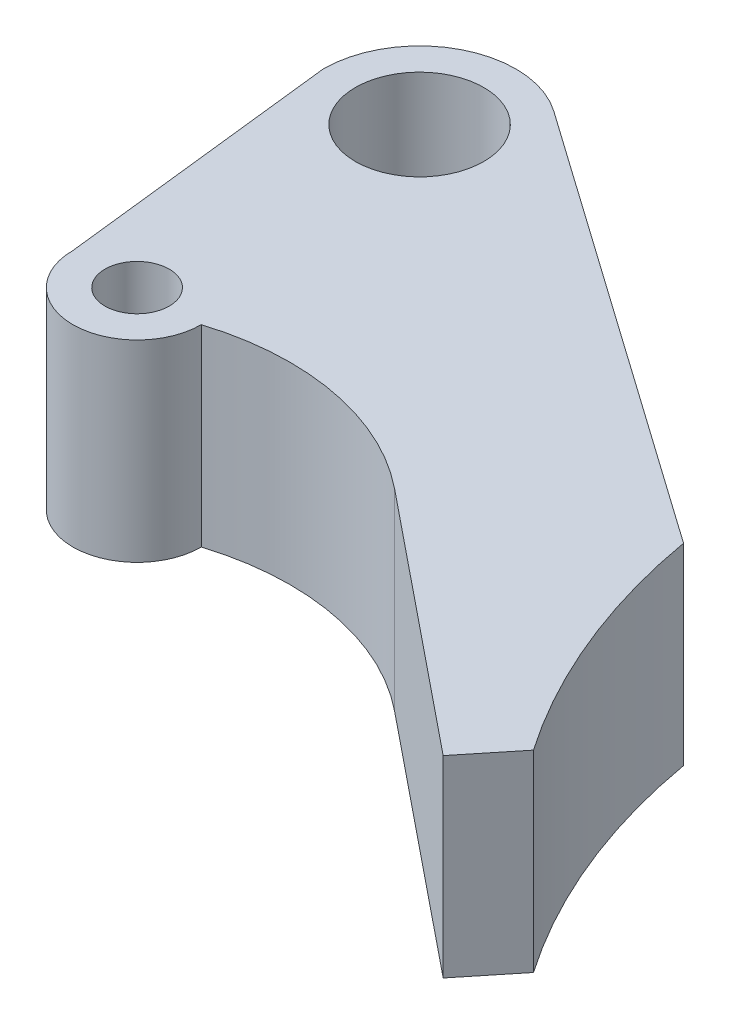
ISO-10303-21;
HEADER;
FILE_DESCRIPTION(('STEP AP214'),'2;1');
FILE_NAME('part.step','',(''),(''),'','','');
FILE_SCHEMA(('AUTOMOTIVE_DESIGN { 1 0 10303 214 1 1 1 1 }'));
ENDSEC;
DATA;
#1=APPLICATION_CONTEXT('core data for automotive mechanical design processes');
#2=APPLICATION_PROTOCOL_DEFINITION('international standard','automotive_design',2000,#1);
#3=PRODUCT_CONTEXT('',#1,'mechanical');
#4=PRODUCT('Part','Part','',(#3));
#5=PRODUCT_RELATED_PRODUCT_CATEGORY('part','',(#4));
#6=PRODUCT_DEFINITION_FORMATION('','',#4);
#7=PRODUCT_DEFINITION_CONTEXT('part definition',#1,'design');
#8=PRODUCT_DEFINITION('design','',#6,#7);
#9=PRODUCT_DEFINITION_SHAPE('','',#8);
#10=(LENGTH_UNIT() NAMED_UNIT(*) SI_UNIT(.MILLI.,.METRE.));
#11=(NAMED_UNIT(*) PLANE_ANGLE_UNIT() SI_UNIT($,.RADIAN.));
#12=(NAMED_UNIT(*) SI_UNIT($,.STERADIAN.) SOLID_ANGLE_UNIT());
#13=UNCERTAINTY_MEASURE_WITH_UNIT(LENGTH_MEASURE(1.E-05),#10,'distance_accuracy_value','');
#14=(GEOMETRIC_REPRESENTATION_CONTEXT(3) GLOBAL_UNCERTAINTY_ASSIGNED_CONTEXT((#13)) GLOBAL_UNIT_ASSIGNED_CONTEXT((#10,
#11,#12)) REPRESENTATION_CONTEXT('',''));
#15=CARTESIAN_POINT('',(0.,0.,0.));
#16=DIRECTION('',(0.,0.,1.));
#17=DIRECTION('',(1.,0.,0.));
#18=AXIS2_PLACEMENT_3D('',#15,#16,#17);
#19=CARTESIAN_POINT('',(175.539976401458,30.,-5.34273223660473));
#20=DIRECTION('',(0.,-1.,0.));
#21=DIRECTION('',(0.,0.,-1.));
#22=AXIS2_PLACEMENT_3D('',#19,#20,#21);
#23=CYLINDRICAL_SURFACE('',#22,100.);
#24=CARTESIAN_POINT('',(175.539976401458,0.,-5.34273223660473));
#25=DIRECTION('',(0.,1.,0.));
#26=DIRECTION('',(0.,0.,1.));
#27=AXIS2_PLACEMENT_3D('',#24,#25,#26);
#28=CIRCLE('',#27,100.);
#29=CARTESIAN_POINT('',(77.0361618981153,0.,11.8909130043512));
#30=VERTEX_POINT('',#29);
#31=CARTESIAN_POINT('',(93.2575153748367,0.,51.4868076823722));
#32=VERTEX_POINT('',#31);
#33=EDGE_CURVE('E146',#30,#32,#28,.T.);
#34=ORIENTED_EDGE('',*,*,#33,.F.);
#35=DIRECTION('',(0.,-1.,0.));
#36=VECTOR('',#35,1.);
#37=CARTESIAN_POINT('',(77.0361618981153,30.,11.8909130043512));
#38=LINE('',#37,#36);
#39=CARTESIAN_POINT('',(77.0361618981153,30.,11.8909130043512));
#40=VERTEX_POINT('',#39);
#41=EDGE_CURVE('E11',#40,#30,#38,.T.);
#42=ORIENTED_EDGE('',*,*,#41,.F.);
#43=CARTESIAN_POINT('',(175.539976401458,30.,-5.34273223660473));
#44=DIRECTION('',(0.,1.,0.));
#45=DIRECTION('',(0.,0.,1.));
#46=AXIS2_PLACEMENT_3D('',#43,#44,#45);
#47=CIRCLE('',#46,100.);
#48=CARTESIAN_POINT('',(93.2575153748367,30.,51.4868076823722));
#49=VERTEX_POINT('',#48);
#50=EDGE_CURVE('E179',#40,#49,#47,.T.);
#51=ORIENTED_EDGE('',*,*,#50,.T.);
#52=DIRECTION('',(0.,-1.,0.));
#53=VECTOR('',#52,1.);
#54=CARTESIAN_POINT('',(93.2575153748367,30.,51.4868076823722));
#55=LINE('',#54,#53);
#56=EDGE_CURVE('E55',#49,#32,#55,.T.);
#57=ORIENTED_EDGE('',*,*,#56,.T.);
#58=EDGE_LOOP('',(#34,#42,#51,#57));
#59=FACE_BOUND('',#58,.T.);
#60=ADVANCED_FACE('F38',(#59),#23,.F.);
#61=CARTESIAN_POINT('',(19.9533882722005,30.,-28.3232347309496));
#62=DIRECTION('',(-0.575922322514416,0.,0.817504421045905));
#63=DIRECTION('',(0.817504421045905,0.,0.575922322514416));
#64=AXIS2_PLACEMENT_3D('',#61,#62,#63);
#65=PLANE('',#64);
#66=DIRECTION('',(-0.817504421045905,0.,-0.575922322514416));
#67=VECTOR('',#66,1.);
#68=CARTESIAN_POINT('',(19.9533882722005,0.,-28.3232347309496));
#69=LINE('',#68,#67);
#70=CARTESIAN_POINT('',(8.63883483771625,0.,-36.2942055592966));
#71=VERTEX_POINT('',#70);
#72=EDGE_CURVE('E149',#30,#71,#69,.T.);
#73=ORIENTED_EDGE('',*,*,#72,.T.);
#74=DIRECTION('',(0.,-1.,0.));
#75=VECTOR('',#74,1.);
#76=CARTESIAN_POINT('',(8.63883483771625,30.,-36.2942055592966));
#77=LINE('',#76,#75);
#78=CARTESIAN_POINT('',(8.63883483771625,30.,-36.2942055592966));
#79=VERTEX_POINT('',#78);
#80=EDGE_CURVE('E47',#79,#71,#77,.T.);
#81=ORIENTED_EDGE('',*,*,#80,.F.);
#82=DIRECTION('',(-0.817504421045905,0.,-0.575922322514416));
#83=VECTOR('',#82,1.);
#84=CARTESIAN_POINT('',(19.9533882722005,30.,-28.3232347309496));
#85=LINE('',#84,#83);
#86=EDGE_CURVE('E224',#40,#79,#85,.T.);
#87=ORIENTED_EDGE('',*,*,#86,.F.);
#88=ORIENTED_EDGE('',*,*,#41,.T.);
#89=EDGE_LOOP('',(#73,#81,#87,#88));
#90=FACE_BOUND('',#89,.T.);
#91=ADVANCED_FACE('F244',(#90),#65,.F.);
#92=CARTESIAN_POINT('',(0.,30.,-24.0316392436081));
#93=DIRECTION('',(0.,-1.,0.));
#94=DIRECTION('',(0.,0.,-1.));
#95=AXIS2_PLACEMENT_3D('',#92,#93,#94);
#96=CYLINDRICAL_SURFACE('',#95,15.);
#97=CARTESIAN_POINT('',(0.,0.,-24.0316392436081));
#98=DIRECTION('',(0.,1.,0.));
#99=DIRECTION('',(0.,0.,1.));
#100=AXIS2_PLACEMENT_3D('',#97,#98,#99);
#101=CIRCLE('',#100,15.);
#102=CARTESIAN_POINT('',(-15.,0.,-24.0316392436081));
#103=VERTEX_POINT('',#102);
#104=EDGE_CURVE('E152',#71,#103,#101,.T.);
#105=ORIENTED_EDGE('',*,*,#104,.T.);
#106=DIRECTION('',(0.,-1.,0.));
#107=VECTOR('',#106,1.);
#108=CARTESIAN_POINT('',(-15.,30.,-24.0316392436081));
#109=LINE('',#108,#107);
#110=CARTESIAN_POINT('',(-15.,30.,-24.0316392436081));
#111=VERTEX_POINT('',#110);
#112=EDGE_CURVE('E190',#111,#103,#109,.T.);
#113=ORIENTED_EDGE('',*,*,#112,.F.);
#114=CARTESIAN_POINT('',(0.,30.,-24.0316392436081));
#115=DIRECTION('',(0.,1.,0.));
#116=DIRECTION('',(0.,0.,1.));
#117=AXIS2_PLACEMENT_3D('',#114,#115,#116);
#118=CIRCLE('',#117,15.);
#119=EDGE_CURVE('E202',#79,#111,#118,.T.);
#120=ORIENTED_EDGE('',*,*,#119,.F.);
#121=ORIENTED_EDGE('',*,*,#80,.T.);
#122=EDGE_LOOP('',(#105,#113,#120,#121));
#123=FACE_BOUND('',#122,.T.);
#124=ADVANCED_FACE('F200',(#123),#96,.T.);
#125=CARTESIAN_POINT('',(-12.1127176779226,30.,1.37644519067301));
#126=DIRECTION('',(0.993605254789719,0.,-0.112909688044285));
#127=DIRECTION('',(-0.112909688044285,0.,-0.993605254789719));
#128=AXIS2_PLACEMENT_3D('',#125,#126,#127);
#129=PLANE('',#128);
#130=DIRECTION('',(0.112909688044285,0.,0.993605254789719));
#131=VECTOR('',#130,1.);
#132=CARTESIAN_POINT('',(-12.1127176779226,0.,1.37644519067301));
#133=LINE('',#132,#131);
#134=CARTESIAN_POINT('',(-10.,0.,19.9683607563919));
#135=VERTEX_POINT('',#134);
#136=EDGE_CURVE('E155',#103,#135,#133,.T.);
#137=ORIENTED_EDGE('',*,*,#136,.T.);
#138=DIRECTION('',(0.,-1.,0.));
#139=VECTOR('',#138,1.);
#140=CARTESIAN_POINT('',(-10.,30.,19.9683607563919));
#141=LINE('',#140,#139);
#142=CARTESIAN_POINT('',(-10.,30.,19.9683607563919));
#143=VERTEX_POINT('',#142);
#144=EDGE_CURVE('E186',#143,#135,#141,.T.);
#145=ORIENTED_EDGE('',*,*,#144,.F.);
#146=DIRECTION('',(0.112909688044285,0.,0.993605254789719));
#147=VECTOR('',#146,1.);
#148=CARTESIAN_POINT('',(-12.1127176779226,30.,1.37644519067301));
#149=LINE('',#148,#147);
#150=EDGE_CURVE('E217',#111,#143,#149,.T.);
#151=ORIENTED_EDGE('',*,*,#150,.F.);
#152=ORIENTED_EDGE('',*,*,#112,.T.);
#153=EDGE_LOOP('',(#137,#145,#151,#152));
#154=FACE_BOUND('',#153,.T.);
#155=ADVANCED_FACE('F212',(#154),#129,.F.);
#156=CARTESIAN_POINT('',(0.,30.,19.9683607563919));
#157=DIRECTION('',(0.,-1.,0.));
#158=DIRECTION('',(0.,0.,-1.));
#159=AXIS2_PLACEMENT_3D('',#156,#157,#158);
#160=CYLINDRICAL_SURFACE('',#159,9.99999999999999);
#161=CARTESIAN_POINT('',(0.,0.,19.9683607563919));
#162=DIRECTION('',(0.,1.,0.));
#163=DIRECTION('',(0.,0.,1.));
#164=AXIS2_PLACEMENT_3D('',#161,#162,#163);
#165=CIRCLE('',#164,9.99999999999999);
#166=CARTESIAN_POINT('',(10.,0.,19.9683607563919));
#167=VERTEX_POINT('',#166);
#168=EDGE_CURVE('E158',#135,#167,#165,.T.);
#169=ORIENTED_EDGE('',*,*,#168,.T.);
#170=DIRECTION('',(0.,-1.,0.));
#171=VECTOR('',#170,1.);
#172=CARTESIAN_POINT('',(10.,30.,19.9683607563919));
#173=LINE('',#172,#171);
#174=CARTESIAN_POINT('',(10.,30.,19.9683607563919));
#175=VERTEX_POINT('',#174);
#176=EDGE_CURVE('E115',#175,#167,#173,.T.);
#177=ORIENTED_EDGE('',*,*,#176,.F.);
#178=CARTESIAN_POINT('',(0.,30.,19.9683607563919));
#179=DIRECTION('',(0.,1.,0.));
#180=DIRECTION('',(0.,0.,1.));
#181=AXIS2_PLACEMENT_3D('',#178,#179,#180);
#182=CIRCLE('',#181,9.99999999999999);
#183=EDGE_CURVE('E125',#143,#175,#182,.T.);
#184=ORIENTED_EDGE('',*,*,#183,.F.);
#185=ORIENTED_EDGE('',*,*,#144,.T.);
#186=EDGE_LOOP('',(#169,#177,#184,#185));
#187=FACE_BOUND('',#186,.T.);
#188=ADVANCED_FACE('F215',(#187),#160,.T.);
#189=CARTESIAN_POINT('',(22.0038610111941,30.,58.1247143665567));
#190=DIRECTION('',(0.,-1.,0.));
#191=DIRECTION('',(0.,0.,-1.));
#192=AXIS2_PLACEMENT_3D('',#189,#190,#191);
#193=CYLINDRICAL_SURFACE('',#192,40.);
#194=CARTESIAN_POINT('',(22.0038610111941,0.,58.1247143665567));
#195=DIRECTION('',(0.,1.,0.));
#196=DIRECTION('',(0.,0.,1.));
#197=AXIS2_PLACEMENT_3D('',#194,#195,#196);
#198=CIRCLE('',#197,40.);
#199=CARTESIAN_POINT('',(47.1766766531877,0.,27.038875908278));
#200=VERTEX_POINT('',#199);
#201=EDGE_CURVE('E110',#200,#167,#198,.T.);
#202=ORIENTED_EDGE('',*,*,#201,.F.);
#203=DIRECTION('',(0.,-1.,0.));
#204=VECTOR('',#203,1.);
#205=CARTESIAN_POINT('',(47.1766766531877,30.,27.038875908278));
#206=LINE('',#205,#204);
#207=CARTESIAN_POINT('',(47.1766766531877,30.,27.038875908278));
#208=VERTEX_POINT('',#207);
#209=EDGE_CURVE('E105',#208,#200,#206,.T.);
#210=ORIENTED_EDGE('',*,*,#209,.F.);
#211=CARTESIAN_POINT('',(22.0038610111941,30.,58.1247143665567));
#212=DIRECTION('',(0.,1.,0.));
#213=DIRECTION('',(0.,0.,1.));
#214=AXIS2_PLACEMENT_3D('',#211,#212,#213);
#215=CIRCLE('',#214,40.);
#216=EDGE_CURVE('E108',#208,#175,#215,.T.);
#217=ORIENTED_EDGE('',*,*,#216,.T.);
#218=ORIENTED_EDGE('',*,*,#176,.T.);
#219=EDGE_LOOP('',(#202,#210,#217,#218));
#220=FACE_BOUND('',#219,.T.);
#221=ADVANCED_FACE('F107',(#220),#193,.F.);
#222=CARTESIAN_POINT('',(5.46004122341992,30.,-6.74258938136537));
#223=DIRECTION('',(-0.629320391049841,0.,0.777145961456968));
#224=DIRECTION('',(0.777145961456968,0.,0.629320391049841));
#225=AXIS2_PLACEMENT_3D('',#222,#223,#224);
#226=PLANE('',#225);
#227=DIRECTION('',(-0.777145961456968,0.,-0.629320391049841));
#228=VECTOR('',#227,1.);
#229=CARTESIAN_POINT('',(5.46004122341992,0.,-6.74258938136537));
#230=LINE('',#229,#228);
#231=CARTESIAN_POINT('',(86.9643114643383,0.,59.2582672969419));
#232=VERTEX_POINT('',#231);
#233=EDGE_CURVE('E164',#232,#200,#230,.T.);
#234=ORIENTED_EDGE('',*,*,#233,.F.);
#235=DIRECTION('',(0.,-1.,0.));
#236=VECTOR('',#235,1.);
#237=CARTESIAN_POINT('',(86.9643114643383,30.,59.2582672969419));
#238=LINE('',#237,#236);
#239=CARTESIAN_POINT('',(86.9643114643383,30.,59.2582672969419));
#240=VERTEX_POINT('',#239);
#241=EDGE_CURVE('E80',#240,#232,#238,.T.);
#242=ORIENTED_EDGE('',*,*,#241,.F.);
#243=DIRECTION('',(-0.777145961456968,0.,-0.629320391049841));
#244=VECTOR('',#243,1.);
#245=CARTESIAN_POINT('',(5.46004122341992,30.,-6.74258938136537));
#246=LINE('',#245,#244);
#247=EDGE_CURVE('E123',#240,#208,#246,.T.);
#248=ORIENTED_EDGE('',*,*,#247,.T.);
#249=ORIENTED_EDGE('',*,*,#209,.T.);
#250=EDGE_LOOP('',(#234,#242,#248,#249));
#251=FACE_BOUND('',#250,.T.);
#252=ADVANCED_FACE('F129',(#251),#226,.T.);
#253=CARTESIAN_POINT('',(0.,30.,-24.0316392436081));
#254=DIRECTION('',(0.,-1.,0.));
#255=DIRECTION('',(0.,0.,-1.));
#256=AXIS2_PLACEMENT_3D('',#253,#254,#255);
#257=CYLINDRICAL_SURFACE('',#256,10.);
#258=CARTESIAN_POINT('',(0.,30.,-24.0316392436081));
#259=DIRECTION('',(0.,1.,0.));
#260=DIRECTION('',(0.,0.,1.));
#261=AXIS2_PLACEMENT_3D('',#258,#259,#260);
#262=CIRCLE('',#261,10.);
#263=CARTESIAN_POINT('',(0.,30.,-14.0316392436081));
#264=VERTEX_POINT('',#263);
#265=EDGE_CURVE('E135',#264,#264,#262,.T.);
#266=ORIENTED_EDGE('',*,*,#265,.T.);
#267=EDGE_LOOP('',(#266));
#268=FACE_BOUND('',#267,.T.);
#269=CARTESIAN_POINT('',(0.,0.,-24.0316392436081));
#270=DIRECTION('',(0.,1.,0.));
#271=DIRECTION('',(0.,0.,1.));
#272=AXIS2_PLACEMENT_3D('',#269,#270,#271);
#273=CIRCLE('',#272,10.);
#274=CARTESIAN_POINT('',(0.,0.,-14.0316392436081));
#275=VERTEX_POINT('',#274);
#276=EDGE_CURVE('E171',#275,#275,#273,.T.);
#277=ORIENTED_EDGE('',*,*,#276,.F.);
#278=EDGE_LOOP('',(#277));
#279=FACE_BOUND('',#278,.T.);
#280=ADVANCED_FACE('F232',(#268,#279),#257,.F.);
#281=CARTESIAN_POINT('',(81.5042702409184,30.,66.0008566783072));
#282=DIRECTION('',(0.777145961456969,0.,0.62932039104984));
#283=DIRECTION('',(0.62932039104984,0.,-0.777145961456969));
#284=AXIS2_PLACEMENT_3D('',#281,#282,#283);
#285=PLANE('',#284);
#286=DIRECTION('',(-0.62932039104984,0.,0.777145961456969));
#287=VECTOR('',#286,1.);
#288=CARTESIAN_POINT('',(81.5042702409184,0.,66.0008566783072));
#289=LINE('',#288,#287);
#290=EDGE_CURVE('E167',#32,#232,#289,.T.);
#291=ORIENTED_EDGE('',*,*,#290,.F.);
#292=ORIENTED_EDGE('',*,*,#56,.F.);
#293=DIRECTION('',(-0.62932039104984,0.,0.777145961456969));
#294=VECTOR('',#293,1.);
#295=CARTESIAN_POINT('',(81.5042702409184,30.,66.0008566783072));
#296=LINE('',#295,#294);
#297=EDGE_CURVE('E131',#49,#240,#296,.T.);
#298=ORIENTED_EDGE('',*,*,#297,.T.);
#299=ORIENTED_EDGE('',*,*,#241,.T.);
#300=EDGE_LOOP('',(#291,#292,#298,#299));
#301=FACE_BOUND('',#300,.T.);
#302=ADVANCED_FACE('F229',(#301),#285,.T.);
#303=CARTESIAN_POINT('',(0.,30.,19.9683607563919));
#304=DIRECTION('',(0.,-1.,0.));
#305=DIRECTION('',(0.,0.,-1.));
#306=AXIS2_PLACEMENT_3D('',#303,#304,#305);
#307=CYLINDRICAL_SURFACE('',#306,5.);
#308=CARTESIAN_POINT('',(0.,30.,19.9683607563919));
#309=DIRECTION('',(0.,1.,0.));
#310=DIRECTION('',(0.,0.,1.));
#311=AXIS2_PLACEMENT_3D('',#308,#309,#310);
#312=CIRCLE('',#311,5.);
#313=CARTESIAN_POINT('',(0.,30.,24.9683607563919));
#314=VERTEX_POINT('',#313);
#315=EDGE_CURVE('E142',#314,#314,#312,.T.);
#316=ORIENTED_EDGE('',*,*,#315,.T.);
#317=EDGE_LOOP('',(#316));
#318=FACE_BOUND('',#317,.T.);
#319=CARTESIAN_POINT('',(0.,0.,19.9683607563919));
#320=DIRECTION('',(0.,1.,0.));
#321=DIRECTION('',(0.,0.,1.));
#322=AXIS2_PLACEMENT_3D('',#319,#320,#321);
#323=CIRCLE('',#322,5.);
#324=CARTESIAN_POINT('',(0.,0.,24.9683607563919));
#325=VERTEX_POINT('',#324);
#326=EDGE_CURVE('E175',#325,#325,#323,.T.);
#327=ORIENTED_EDGE('',*,*,#326,.F.);
#328=EDGE_LOOP('',(#327));
#329=FACE_BOUND('',#328,.T.);
#330=ADVANCED_FACE('F231',(#318,#329),#307,.F.);
#331=CARTESIAN_POINT('',(0.,30.,0.));
#332=DIRECTION('',(0.,1.,0.));
#333=DIRECTION('',(0.,0.,1.));
#334=AXIS2_PLACEMENT_3D('',#331,#332,#333);
#335=PLANE('',#334);
#336=ORIENTED_EDGE('',*,*,#50,.F.);
#337=ORIENTED_EDGE('',*,*,#86,.T.);
#338=ORIENTED_EDGE('',*,*,#119,.T.);
#339=ORIENTED_EDGE('',*,*,#150,.T.);
#340=ORIENTED_EDGE('',*,*,#183,.T.);
#341=ORIENTED_EDGE('',*,*,#216,.F.);
#342=ORIENTED_EDGE('',*,*,#247,.F.);
#343=ORIENTED_EDGE('',*,*,#297,.F.);
#344=EDGE_LOOP('',(#336,#337,#338,#339,#340,#341,#342,#343));
#345=FACE_BOUND('',#344,.T.);
#346=ORIENTED_EDGE('',*,*,#265,.F.);
#347=EDGE_LOOP('',(#346));
#348=FACE_BOUND('',#347,.T.);
#349=ORIENTED_EDGE('',*,*,#315,.F.);
#350=EDGE_LOOP('',(#349));
#351=FACE_BOUND('',#350,.T.);
#352=ADVANCED_FACE('F120',(#345,#348,#351),#335,.T.);
#353=CARTESIAN_POINT('',(0.,0.,0.));
#354=DIRECTION('',(0.,1.,0.));
#355=DIRECTION('',(0.,0.,1.));
#356=AXIS2_PLACEMENT_3D('',#353,#354,#355);
#357=PLANE('',#356);
#358=ORIENTED_EDGE('',*,*,#33,.T.);
#359=ORIENTED_EDGE('',*,*,#290,.T.);
#360=ORIENTED_EDGE('',*,*,#233,.T.);
#361=ORIENTED_EDGE('',*,*,#201,.T.);
#362=ORIENTED_EDGE('',*,*,#168,.F.);
#363=ORIENTED_EDGE('',*,*,#136,.F.);
#364=ORIENTED_EDGE('',*,*,#104,.F.);
#365=ORIENTED_EDGE('',*,*,#72,.F.);
#366=EDGE_LOOP('',(#358,#359,#360,#361,#362,#363,#364,#365));
#367=FACE_BOUND('',#366,.T.);
#368=ORIENTED_EDGE('',*,*,#276,.T.);
#369=EDGE_LOOP('',(#368));
#370=FACE_BOUND('',#369,.T.);
#371=ORIENTED_EDGE('',*,*,#326,.T.);
#372=EDGE_LOOP('',(#371));
#373=FACE_BOUND('',#372,.T.);
#374=ADVANCED_FACE('F207',(#367,#370,#373),#357,.F.);
#375=CLOSED_SHELL('',(#60,#91,#124,#155,#188,#221,#252,#280,#302,#330,#352,#374));
#376=MANIFOLD_SOLID_BREP('B2',#375);
#377=ADVANCED_BREP_SHAPE_REPRESENTATION('',(#18,#376),#14);
#378=SHAPE_DEFINITION_REPRESENTATION(#9,#377);
ENDSEC;
END-ISO-10303-21;
